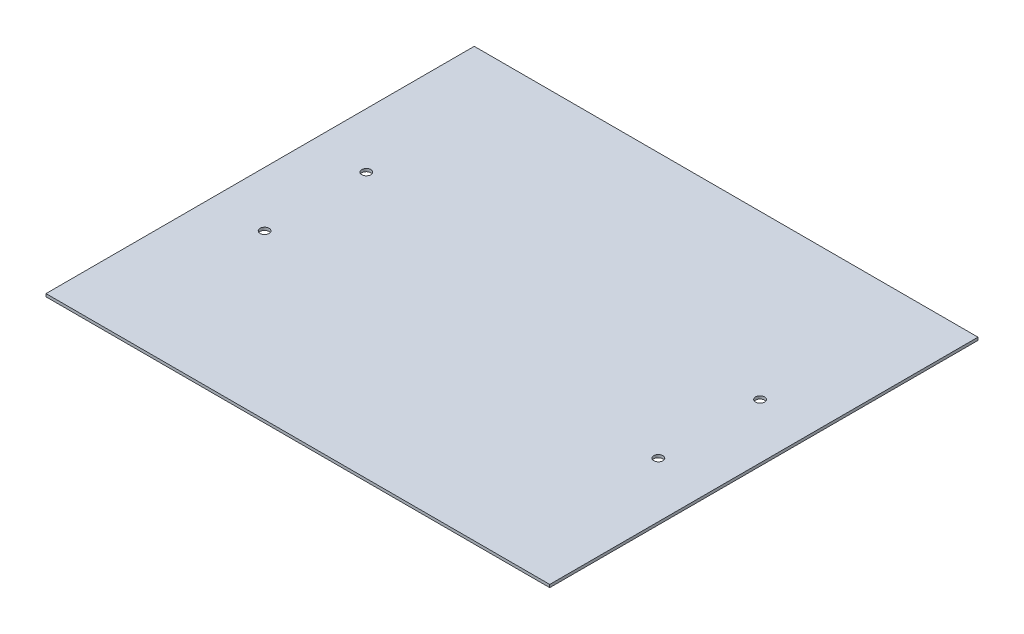
ISO-10303-21;
HEADER;
FILE_DESCRIPTION(('STEP AP214'),'2;1');
FILE_NAME('part.step','',(''),(''),'','','');
FILE_SCHEMA(('AUTOMOTIVE_DESIGN { 1 0 10303 214 1 1 1 1 }'));
ENDSEC;
DATA;
#1=APPLICATION_CONTEXT('core data for automotive mechanical design processes');
#2=APPLICATION_PROTOCOL_DEFINITION('international standard','automotive_design',2000,#1);
#3=PRODUCT_CONTEXT('',#1,'mechanical');
#4=PRODUCT('Part','Part','',(#3));
#5=PRODUCT_RELATED_PRODUCT_CATEGORY('part','',(#4));
#6=PRODUCT_DEFINITION_FORMATION('','',#4);
#7=PRODUCT_DEFINITION_CONTEXT('part definition',#1,'design');
#8=PRODUCT_DEFINITION('design','',#6,#7);
#9=PRODUCT_DEFINITION_SHAPE('','',#8);
#10=(LENGTH_UNIT() NAMED_UNIT(*) SI_UNIT(.MILLI.,.METRE.));
#11=(NAMED_UNIT(*) PLANE_ANGLE_UNIT() SI_UNIT($,.RADIAN.));
#12=(NAMED_UNIT(*) SI_UNIT($,.STERADIAN.) SOLID_ANGLE_UNIT());
#13=UNCERTAINTY_MEASURE_WITH_UNIT(LENGTH_MEASURE(1.E-05),#10,'distance_accuracy_value','');
#14=(GEOMETRIC_REPRESENTATION_CONTEXT(3) GLOBAL_UNCERTAINTY_ASSIGNED_CONTEXT((#13)) GLOBAL_UNIT_ASSIGNED_CONTEXT((#10,
#11,#12)) REPRESENTATION_CONTEXT('',''));
#15=CARTESIAN_POINT('',(0.,0.,0.));
#16=DIRECTION('',(0.,0.,1.));
#17=DIRECTION('',(1.,0.,0.));
#18=AXIS2_PLACEMENT_3D('',#15,#16,#17);
#19=CARTESIAN_POINT('',(0.,3.0734,0.));
#20=DIRECTION('',(0.,1.,0.));
#21=DIRECTION('',(0.,0.,1.));
#22=AXIS2_PLACEMENT_3D('',#19,#20,#21);
#23=PLANE('',#22);
#24=CARTESIAN_POINT('',(213.36,3.0734,-55.4693666666667));
#25=DIRECTION('',(0.,1.,0.));
#26=DIRECTION('',(0.,0.,1.));
#27=AXIS2_PLACEMENT_3D('',#24,#25,#26);
#28=CIRCLE('',#27,4.9022);
#29=CARTESIAN_POINT('',(213.36,3.0734,-50.5671666666667));
#30=VERTEX_POINT('',#29);
#31=EDGE_CURVE('E41',#30,#30,#28,.T.);
#32=ORIENTED_EDGE('',*,*,#31,.F.);
#33=EDGE_LOOP('',(#32));
#34=FACE_BOUND('',#33,.T.);
#35=CARTESIAN_POINT('',(213.36,3.0734,54.7327666666667));
#36=DIRECTION('',(0.,1.,0.));
#37=DIRECTION('',(0.,0.,1.));
#38=AXIS2_PLACEMENT_3D('',#35,#36,#37);
#39=CIRCLE('',#38,4.9022);
#40=CARTESIAN_POINT('',(213.36,3.0734,59.6349666666666));
#41=VERTEX_POINT('',#40);
#42=EDGE_CURVE('E119',#41,#41,#39,.T.);
#43=ORIENTED_EDGE('',*,*,#42,.F.);
#44=EDGE_LOOP('',(#43));
#45=FACE_BOUND('',#44,.T.);
#46=CARTESIAN_POINT('',(-213.36,3.0734,54.7327666666667));
#47=DIRECTION('',(0.,1.,0.));
#48=DIRECTION('',(0.,0.,1.));
#49=AXIS2_PLACEMENT_3D('',#46,#47,#48);
#50=CIRCLE('',#49,4.9022);
#51=CARTESIAN_POINT('',(-213.36,3.0734,59.6349666666667));
#52=VERTEX_POINT('',#51);
#53=EDGE_CURVE('E113',#52,#52,#50,.T.);
#54=ORIENTED_EDGE('',*,*,#53,.F.);
#55=EDGE_LOOP('',(#54));
#56=FACE_BOUND('',#55,.T.);
#57=CARTESIAN_POINT('',(-213.36,3.0734,-55.4693666666666));
#58=DIRECTION('',(0.,1.,0.));
#59=DIRECTION('',(0.,0.,1.));
#60=AXIS2_PLACEMENT_3D('',#57,#58,#59);
#61=CIRCLE('',#60,4.9022);
#62=CARTESIAN_POINT('',(-213.36,3.0734,-50.5671666666667));
#63=VERTEX_POINT('',#62);
#64=EDGE_CURVE('E105',#63,#63,#61,.T.);
#65=ORIENTED_EDGE('',*,*,#64,.F.);
#66=EDGE_LOOP('',(#65));
#67=FACE_BOUND('',#66,.T.);
#68=DIRECTION('',(0.,0.,1.));
#69=VECTOR('',#68,1.);
#70=CARTESIAN_POINT('',(-272.9738,3.0734,232.0671));
#71=LINE('',#70,#69);
#72=CARTESIAN_POINT('',(-272.9738,3.0734,-232.0671));
#73=VERTEX_POINT('',#72);
#74=CARTESIAN_POINT('',(-272.9738,3.0734,232.0671));
#75=VERTEX_POINT('',#74);
#76=EDGE_CURVE('E80',#73,#75,#71,.T.);
#77=ORIENTED_EDGE('',*,*,#76,.T.);
#78=DIRECTION('',(1.,0.,0.));
#79=VECTOR('',#78,1.);
#80=CARTESIAN_POINT('',(-272.9738,3.0734,232.0671));
#81=LINE('',#80,#79);
#82=CARTESIAN_POINT('',(272.9738,3.0734,232.0671));
#83=VERTEX_POINT('',#82);
#84=EDGE_CURVE('E97',#75,#83,#81,.T.);
#85=ORIENTED_EDGE('',*,*,#84,.T.);
#86=DIRECTION('',(0.,0.,-1.));
#87=VECTOR('',#86,1.);
#88=CARTESIAN_POINT('',(272.9738,3.0734,232.0671));
#89=LINE('',#88,#87);
#90=CARTESIAN_POINT('',(272.9738,3.0734,-232.0671));
#91=VERTEX_POINT('',#90);
#92=EDGE_CURVE('E100',#83,#91,#89,.T.);
#93=ORIENTED_EDGE('',*,*,#92,.T.);
#94=DIRECTION('',(-1.,0.,0.));
#95=VECTOR('',#94,1.);
#96=CARTESIAN_POINT('',(-272.9738,3.0734,-232.0671));
#97=LINE('',#96,#95);
#98=EDGE_CURVE('E48',#91,#73,#97,.T.);
#99=ORIENTED_EDGE('',*,*,#98,.T.);
#100=EDGE_LOOP('',(#77,#85,#93,#99));
#101=FACE_BOUND('',#100,.T.);
#102=ADVANCED_FACE('F33',(#34,#45,#56,#67,#101),#23,.T.);
#103=CARTESIAN_POINT('',(0.,0.,0.));
#104=DIRECTION('',(0.,1.,0.));
#105=DIRECTION('',(0.,0.,1.));
#106=AXIS2_PLACEMENT_3D('',#103,#104,#105);
#107=PLANE('',#106);
#108=CARTESIAN_POINT('',(213.36,0.,-55.4693666666667));
#109=DIRECTION('',(0.,1.,0.));
#110=DIRECTION('',(0.,0.,1.));
#111=AXIS2_PLACEMENT_3D('',#108,#109,#110);
#112=CIRCLE('',#111,4.9022);
#113=CARTESIAN_POINT('',(213.36,0.,-50.5671666666667));
#114=VERTEX_POINT('',#113);
#115=EDGE_CURVE('E11',#114,#114,#112,.T.);
#116=ORIENTED_EDGE('',*,*,#115,.T.);
#117=EDGE_LOOP('',(#116));
#118=FACE_BOUND('',#117,.T.);
#119=CARTESIAN_POINT('',(213.36,0.,54.7327666666667));
#120=DIRECTION('',(0.,1.,0.));
#121=DIRECTION('',(0.,0.,1.));
#122=AXIS2_PLACEMENT_3D('',#119,#120,#121);
#123=CIRCLE('',#122,4.9022);
#124=CARTESIAN_POINT('',(213.36,0.,59.6349666666666));
#125=VERTEX_POINT('',#124);
#126=EDGE_CURVE('E122',#125,#125,#123,.T.);
#127=ORIENTED_EDGE('',*,*,#126,.T.);
#128=EDGE_LOOP('',(#127));
#129=FACE_BOUND('',#128,.T.);
#130=CARTESIAN_POINT('',(-213.36,0.,54.7327666666667));
#131=DIRECTION('',(0.,1.,0.));
#132=DIRECTION('',(0.,0.,1.));
#133=AXIS2_PLACEMENT_3D('',#130,#131,#132);
#134=CIRCLE('',#133,4.9022);
#135=CARTESIAN_POINT('',(-213.36,0.,59.6349666666667));
#136=VERTEX_POINT('',#135);
#137=EDGE_CURVE('E116',#136,#136,#134,.T.);
#138=ORIENTED_EDGE('',*,*,#137,.T.);
#139=EDGE_LOOP('',(#138));
#140=FACE_BOUND('',#139,.T.);
#141=CARTESIAN_POINT('',(-213.36,0.,-55.4693666666666));
#142=DIRECTION('',(0.,1.,0.));
#143=DIRECTION('',(0.,0.,1.));
#144=AXIS2_PLACEMENT_3D('',#141,#142,#143);
#145=CIRCLE('',#144,4.9022);
#146=CARTESIAN_POINT('',(-213.36,0.,-50.5671666666667));
#147=VERTEX_POINT('',#146);
#148=EDGE_CURVE('E110',#147,#147,#145,.T.);
#149=ORIENTED_EDGE('',*,*,#148,.T.);
#150=EDGE_LOOP('',(#149));
#151=FACE_BOUND('',#150,.T.);
#152=DIRECTION('',(1.,0.,0.));
#153=VECTOR('',#152,1.);
#154=CARTESIAN_POINT('',(-272.9738,0.,232.0671));
#155=LINE('',#154,#153);
#156=CARTESIAN_POINT('',(-272.9738,0.,232.0671));
#157=VERTEX_POINT('',#156);
#158=CARTESIAN_POINT('',(272.9738,0.,232.0671));
#159=VERTEX_POINT('',#158);
#160=EDGE_CURVE('E56',#157,#159,#155,.T.);
#161=ORIENTED_EDGE('',*,*,#160,.F.);
#162=DIRECTION('',(0.,0.,1.));
#163=VECTOR('',#162,1.);
#164=CARTESIAN_POINT('',(-272.9738,0.,232.0671));
#165=LINE('',#164,#163);
#166=CARTESIAN_POINT('',(-272.9738,0.,-232.0671));
#167=VERTEX_POINT('',#166);
#168=EDGE_CURVE('E78',#167,#157,#165,.T.);
#169=ORIENTED_EDGE('',*,*,#168,.F.);
#170=DIRECTION('',(-1.,0.,0.));
#171=VECTOR('',#170,1.);
#172=CARTESIAN_POINT('',(-272.9738,0.,-232.0671));
#173=LINE('',#172,#171);
#174=CARTESIAN_POINT('',(272.9738,0.,-232.0671));
#175=VERTEX_POINT('',#174);
#176=EDGE_CURVE('E85',#175,#167,#173,.T.);
#177=ORIENTED_EDGE('',*,*,#176,.F.);
#178=DIRECTION('',(0.,0.,-1.));
#179=VECTOR('',#178,1.);
#180=CARTESIAN_POINT('',(272.9738,0.,232.0671));
#181=LINE('',#180,#179);
#182=EDGE_CURVE('E90',#159,#175,#181,.T.);
#183=ORIENTED_EDGE('',*,*,#182,.F.);
#184=EDGE_LOOP('',(#161,#169,#177,#183));
#185=FACE_BOUND('',#184,.T.);
#186=ADVANCED_FACE('F35',(#118,#129,#140,#151,#185),#107,.F.);
#187=CARTESIAN_POINT('',(213.36,3.0734,-55.4693666666667));
#188=DIRECTION('',(0.,1.,0.));
#189=DIRECTION('',(0.,0.,1.));
#190=AXIS2_PLACEMENT_3D('',#187,#188,#189);
#191=CYLINDRICAL_SURFACE('',#190,4.9022);
#192=ORIENTED_EDGE('',*,*,#115,.F.);
#193=EDGE_LOOP('',(#192));
#194=FACE_BOUND('',#193,.T.);
#195=ORIENTED_EDGE('',*,*,#31,.T.);
#196=EDGE_LOOP('',(#195));
#197=FACE_BOUND('',#196,.T.);
#198=ADVANCED_FACE('F127',(#194,#197),#191,.F.);
#199=CARTESIAN_POINT('',(213.36,3.0734,54.7327666666667));
#200=DIRECTION('',(0.,1.,0.));
#201=DIRECTION('',(0.,0.,1.));
#202=AXIS2_PLACEMENT_3D('',#199,#200,#201);
#203=CYLINDRICAL_SURFACE('',#202,4.9022);
#204=ORIENTED_EDGE('',*,*,#126,.F.);
#205=EDGE_LOOP('',(#204));
#206=FACE_BOUND('',#205,.T.);
#207=ORIENTED_EDGE('',*,*,#42,.T.);
#208=EDGE_LOOP('',(#207));
#209=FACE_BOUND('',#208,.T.);
#210=ADVANCED_FACE('F159',(#206,#209),#203,.F.);
#211=CARTESIAN_POINT('',(-213.36,3.0734,54.7327666666667));
#212=DIRECTION('',(0.,1.,0.));
#213=DIRECTION('',(0.,0.,1.));
#214=AXIS2_PLACEMENT_3D('',#211,#212,#213);
#215=CYLINDRICAL_SURFACE('',#214,4.9022);
#216=ORIENTED_EDGE('',*,*,#137,.F.);
#217=EDGE_LOOP('',(#216));
#218=FACE_BOUND('',#217,.T.);
#219=ORIENTED_EDGE('',*,*,#53,.T.);
#220=EDGE_LOOP('',(#219));
#221=FACE_BOUND('',#220,.T.);
#222=ADVANCED_FACE('F151',(#218,#221),#215,.F.);
#223=CARTESIAN_POINT('',(-213.36,3.0734,-55.4693666666666));
#224=DIRECTION('',(0.,1.,0.));
#225=DIRECTION('',(0.,0.,1.));
#226=AXIS2_PLACEMENT_3D('',#223,#224,#225);
#227=CYLINDRICAL_SURFACE('',#226,4.9022);
#228=ORIENTED_EDGE('',*,*,#148,.F.);
#229=EDGE_LOOP('',(#228));
#230=FACE_BOUND('',#229,.T.);
#231=ORIENTED_EDGE('',*,*,#64,.T.);
#232=EDGE_LOOP('',(#231));
#233=FACE_BOUND('',#232,.T.);
#234=ADVANCED_FACE('F144',(#230,#233),#227,.F.);
#235=CARTESIAN_POINT('',(-272.9738,0.,232.0671));
#236=DIRECTION('',(0.,0.,1.));
#237=DIRECTION('',(1.,0.,0.));
#238=AXIS2_PLACEMENT_3D('',#235,#236,#237);
#239=PLANE('',#238);
#240=ORIENTED_EDGE('',*,*,#84,.F.);
#241=DIRECTION('',(0.,1.,0.));
#242=VECTOR('',#241,1.);
#243=CARTESIAN_POINT('',(-272.9738,0.,232.0671));
#244=LINE('',#243,#242);
#245=EDGE_CURVE('E81',#157,#75,#244,.T.);
#246=ORIENTED_EDGE('',*,*,#245,.F.);
#247=ORIENTED_EDGE('',*,*,#160,.T.);
#248=DIRECTION('',(0.,1.,0.));
#249=VECTOR('',#248,1.);
#250=CARTESIAN_POINT('',(272.9738,0.,232.0671));
#251=LINE('',#250,#249);
#252=EDGE_CURVE('E92',#159,#83,#251,.T.);
#253=ORIENTED_EDGE('',*,*,#252,.T.);
#254=EDGE_LOOP('',(#240,#246,#247,#253));
#255=FACE_BOUND('',#254,.T.);
#256=ADVANCED_FACE('F142',(#255),#239,.T.);
#257=CARTESIAN_POINT('',(-272.9738,0.,232.0671));
#258=DIRECTION('',(-1.,0.,0.));
#259=DIRECTION('',(0.,0.,1.));
#260=AXIS2_PLACEMENT_3D('',#257,#258,#259);
#261=PLANE('',#260);
#262=ORIENTED_EDGE('',*,*,#76,.F.);
#263=DIRECTION('',(0.,1.,0.));
#264=VECTOR('',#263,1.);
#265=CARTESIAN_POINT('',(-272.9738,0.,-232.0671));
#266=LINE('',#265,#264);
#267=EDGE_CURVE('E74',#167,#73,#266,.T.);
#268=ORIENTED_EDGE('',*,*,#267,.F.);
#269=ORIENTED_EDGE('',*,*,#168,.T.);
#270=ORIENTED_EDGE('',*,*,#245,.T.);
#271=EDGE_LOOP('',(#262,#268,#269,#270));
#272=FACE_BOUND('',#271,.T.);
#273=ADVANCED_FACE('F76',(#272),#261,.T.);
#274=CARTESIAN_POINT('',(-272.9738,0.,-232.0671));
#275=DIRECTION('',(0.,0.,-1.));
#276=DIRECTION('',(-1.,0.,0.));
#277=AXIS2_PLACEMENT_3D('',#274,#275,#276);
#278=PLANE('',#277);
#279=ORIENTED_EDGE('',*,*,#98,.F.);
#280=DIRECTION('',(0.,1.,0.));
#281=VECTOR('',#280,1.);
#282=CARTESIAN_POINT('',(272.9738,0.,-232.0671));
#283=LINE('',#282,#281);
#284=EDGE_CURVE('E82',#175,#91,#283,.T.);
#285=ORIENTED_EDGE('',*,*,#284,.F.);
#286=ORIENTED_EDGE('',*,*,#176,.T.);
#287=ORIENTED_EDGE('',*,*,#267,.T.);
#288=EDGE_LOOP('',(#279,#285,#286,#287));
#289=FACE_BOUND('',#288,.T.);
#290=ADVANCED_FACE('F86',(#289),#278,.T.);
#291=CARTESIAN_POINT('',(272.9738,0.,232.0671));
#292=DIRECTION('',(1.,0.,0.));
#293=DIRECTION('',(0.,0.,-1.));
#294=AXIS2_PLACEMENT_3D('',#291,#292,#293);
#295=PLANE('',#294);
#296=ORIENTED_EDGE('',*,*,#92,.F.);
#297=ORIENTED_EDGE('',*,*,#252,.F.);
#298=ORIENTED_EDGE('',*,*,#182,.T.);
#299=ORIENTED_EDGE('',*,*,#284,.T.);
#300=EDGE_LOOP('',(#296,#297,#298,#299));
#301=FACE_BOUND('',#300,.T.);
#302=ADVANCED_FACE('F140',(#301),#295,.T.);
#303=CLOSED_SHELL('',(#102,#186,#198,#210,#222,#234,#256,#273,#290,#302));
#304=MANIFOLD_SOLID_BREP('B2',#303);
#305=ADVANCED_BREP_SHAPE_REPRESENTATION('',(#18,#304),#14);
#306=SHAPE_DEFINITION_REPRESENTATION(#9,#305);
ENDSEC;
END-ISO-10303-21;
